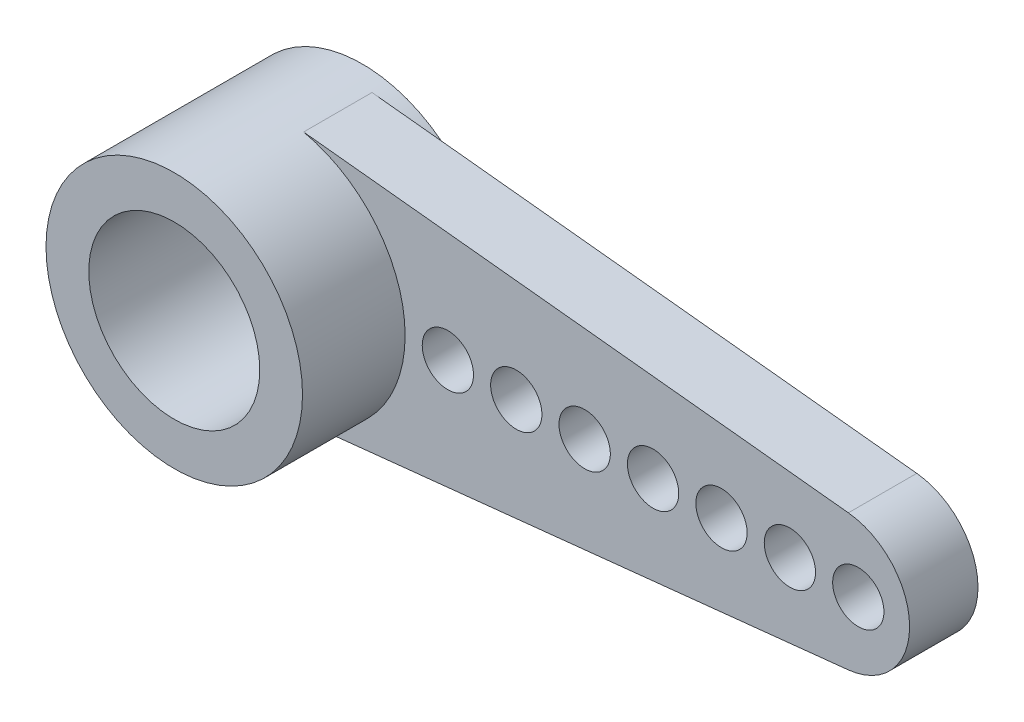
ISO-10303-21;
HEADER;
FILE_DESCRIPTION(('STEP AP214'),'2;1');
FILE_NAME('part.step','',(''),(''),'','','');
FILE_SCHEMA(('AUTOMOTIVE_DESIGN { 1 0 10303 214 1 1 1 1 }'));
ENDSEC;
DATA;
#1=APPLICATION_CONTEXT('core data for automotive mechanical design processes');
#2=APPLICATION_PROTOCOL_DEFINITION('international standard','automotive_design',2000,#1);
#3=PRODUCT_CONTEXT('',#1,'mechanical');
#4=PRODUCT('Part','Part','',(#3));
#5=PRODUCT_RELATED_PRODUCT_CATEGORY('part','',(#4));
#6=PRODUCT_DEFINITION_FORMATION('','',#4);
#7=PRODUCT_DEFINITION_CONTEXT('part definition',#1,'design');
#8=PRODUCT_DEFINITION('design','',#6,#7);
#9=PRODUCT_DEFINITION_SHAPE('','',#8);
#10=(LENGTH_UNIT() NAMED_UNIT(*) SI_UNIT(.MILLI.,.METRE.));
#11=(NAMED_UNIT(*) PLANE_ANGLE_UNIT() SI_UNIT($,.RADIAN.));
#12=(NAMED_UNIT(*) SI_UNIT($,.STERADIAN.) SOLID_ANGLE_UNIT());
#13=UNCERTAINTY_MEASURE_WITH_UNIT(LENGTH_MEASURE(1.E-05),#10,'distance_accuracy_value','');
#14=(GEOMETRIC_REPRESENTATION_CONTEXT(3) GLOBAL_UNCERTAINTY_ASSIGNED_CONTEXT((#13)) GLOBAL_UNIT_ASSIGNED_CONTEXT((#10,
#11,#12)) REPRESENTATION_CONTEXT('',''));
#15=CARTESIAN_POINT('',(0.,0.,0.));
#16=DIRECTION('',(0.,0.,1.));
#17=DIRECTION('',(1.,0.,0.));
#18=AXIS2_PLACEMENT_3D('',#15,#16,#17);
#19=CARTESIAN_POINT('',(0.,0.,-11.6066017177982));
#20=DIRECTION('',(0.,0.,1.));
#21=DIRECTION('',(1.,0.,0.));
#22=AXIS2_PLACEMENT_3D('',#19,#20,#21);
#23=CYLINDRICAL_SURFACE('',#22,2.5);
#24=CARTESIAN_POINT('',(0.,0.,5.));
#25=DIRECTION('',(0.,0.,1.));
#26=DIRECTION('',(1.,0.,0.));
#27=AXIS2_PLACEMENT_3D('',#24,#25,#26);
#28=CIRCLE('',#27,2.5);
#29=CARTESIAN_POINT('',(2.5,0.,5.));
#30=VERTEX_POINT('',#29);
#31=EDGE_CURVE('E140',#30,#30,#28,.T.);
#32=ORIENTED_EDGE('',*,*,#31,.T.);
#33=EDGE_LOOP('',(#32));
#34=FACE_BOUND('',#33,.T.);
#35=CARTESIAN_POINT('',(0.,0.,1.));
#36=DIRECTION('',(0.,0.,-1.));
#37=DIRECTION('',(-1.,0.,0.));
#38=AXIS2_PLACEMENT_3D('',#35,#36,#37);
#39=CIRCLE('',#38,2.5);
#40=CARTESIAN_POINT('',(-2.5,0.,1.));
#41=VERTEX_POINT('',#40);
#42=EDGE_CURVE('E185',#41,#41,#39,.T.);
#43=ORIENTED_EDGE('',*,*,#42,.T.);
#44=EDGE_LOOP('',(#43));
#45=FACE_BOUND('',#44,.T.);
#46=ADVANCED_FACE('F47',(#34,#45),#23,.F.);
#47=CARTESIAN_POINT('',(0.390868604120366,-3.70880662402365,2.));
#48=DIRECTION('',(0.104808874912201,-0.994492382947018,0.));
#49=DIRECTION('',(0.994492382947018,0.104808874912201,0.));
#50=AXIS2_PLACEMENT_3D('',#47,#48,#49);
#51=PLANE('',#50);
#52=DIRECTION('',(-0.994492382947018,-0.104808874912201,0.));
#53=VECTOR('',#52,1.);
#54=CARTESIAN_POINT('',(0.390868604120366,-3.70880662402365,0.));
#55=LINE('',#54,#53);
#56=CARTESIAN_POINT('',(16.7096177498244,-1.98898476589404,0.));
#57=VERTEX_POINT('',#56);
#58=CARTESIAN_POINT('',(0.781737208240732,-3.66761324804729,0.));
#59=VERTEX_POINT('',#58);
#60=EDGE_CURVE('E108',#57,#59,#55,.T.);
#61=ORIENTED_EDGE('',*,*,#60,.F.);
#62=DIRECTION('',(0.,0.,-1.));
#63=VECTOR('',#62,1.);
#64=CARTESIAN_POINT('',(16.7096177498244,-1.98898476589404,2.));
#65=LINE('',#64,#63);
#66=CARTESIAN_POINT('',(16.7096177498244,-1.98898476589404,2.));
#67=VERTEX_POINT('',#66);
#68=EDGE_CURVE('E57',#67,#57,#65,.T.);
#69=ORIENTED_EDGE('',*,*,#68,.F.);
#70=DIRECTION('',(-0.994492382947018,-0.104808874912201,0.));
#71=VECTOR('',#70,1.);
#72=CARTESIAN_POINT('',(0.390868604120366,-3.70880662402365,2.));
#73=LINE('',#72,#71);
#74=CARTESIAN_POINT('',(0.781737208240732,-3.66761324804729,2.));
#75=VERTEX_POINT('',#74);
#76=EDGE_CURVE('E109',#67,#75,#73,.T.);
#77=ORIENTED_EDGE('',*,*,#76,.T.);
#78=DIRECTION('',(0.,0.,-1.));
#79=VECTOR('',#78,1.);
#80=CARTESIAN_POINT('',(0.781737208240728,-3.66761324804729,2.));
#81=LINE('',#80,#79);
#82=EDGE_CURVE('E98',#75,#59,#81,.T.);
#83=ORIENTED_EDGE('',*,*,#82,.T.);
#84=EDGE_LOOP('',(#61,#69,#77,#83));
#85=FACE_BOUND('',#84,.T.);
#86=ADVANCED_FACE('F49',(#85),#51,.T.);
#87=CARTESIAN_POINT('',(16.5,0.,2.));
#88=DIRECTION('',(0.,0.,-1.));
#89=DIRECTION('',(-1.,0.,0.));
#90=AXIS2_PLACEMENT_3D('',#87,#88,#89);
#91=CYLINDRICAL_SURFACE('',#90,2.);
#92=CARTESIAN_POINT('',(16.5,0.,0.));
#93=DIRECTION('',(0.,0.,1.));
#94=DIRECTION('',(1.,0.,0.));
#95=AXIS2_PLACEMENT_3D('',#92,#93,#94);
#96=CIRCLE('',#95,2.);
#97=CARTESIAN_POINT('',(16.7096177498244,1.98898476589404,0.));
#98=VERTEX_POINT('',#97);
#99=EDGE_CURVE('E79',#57,#98,#96,.T.);
#100=ORIENTED_EDGE('',*,*,#99,.T.);
#101=DIRECTION('',(0.,0.,-1.));
#102=VECTOR('',#101,1.);
#103=CARTESIAN_POINT('',(16.7096177498244,1.98898476589404,2.));
#104=LINE('',#103,#102);
#105=CARTESIAN_POINT('',(16.7096177498244,1.98898476589404,2.));
#106=VERTEX_POINT('',#105);
#107=EDGE_CURVE('E97',#106,#98,#104,.T.);
#108=ORIENTED_EDGE('',*,*,#107,.F.);
#109=CARTESIAN_POINT('',(16.5,0.,2.));
#110=DIRECTION('',(0.,0.,1.));
#111=DIRECTION('',(1.,0.,0.));
#112=AXIS2_PLACEMENT_3D('',#109,#110,#111);
#113=CIRCLE('',#112,2.);
#114=EDGE_CURVE('E66',#67,#106,#113,.T.);
#115=ORIENTED_EDGE('',*,*,#114,.F.);
#116=ORIENTED_EDGE('',*,*,#68,.T.);
#117=EDGE_LOOP('',(#100,#108,#115,#116));
#118=FACE_BOUND('',#117,.T.);
#119=ADVANCED_FACE('F227',(#118),#91,.T.);
#120=CARTESIAN_POINT('',(0.390868604120364,3.70880662402365,2.));
#121=DIRECTION('',(-0.104808874912201,-0.994492382947018,0.));
#122=DIRECTION('',(0.994492382947018,-0.104808874912201,0.));
#123=AXIS2_PLACEMENT_3D('',#120,#121,#122);
#124=PLANE('',#123);
#125=DIRECTION('',(-0.994492382947018,0.104808874912201,0.));
#126=VECTOR('',#125,1.);
#127=CARTESIAN_POINT('',(0.390868604120364,3.70880662402365,0.));
#128=LINE('',#127,#126);
#129=CARTESIAN_POINT('',(0.781737208240722,3.66761324804729,0.));
#130=VERTEX_POINT('',#129);
#131=EDGE_CURVE('E101',#98,#130,#128,.T.);
#132=ORIENTED_EDGE('',*,*,#131,.T.);
#133=DIRECTION('',(0.,0.,-1.));
#134=VECTOR('',#133,1.);
#135=CARTESIAN_POINT('',(0.781737208240722,3.66761324804729,2.));
#136=LINE('',#135,#134);
#137=CARTESIAN_POINT('',(0.781737208240727,3.66761324804729,2.));
#138=VERTEX_POINT('',#137);
#139=EDGE_CURVE('E85',#138,#130,#136,.T.);
#140=ORIENTED_EDGE('',*,*,#139,.F.);
#141=DIRECTION('',(-0.994492382947018,0.104808874912201,0.));
#142=VECTOR('',#141,1.);
#143=CARTESIAN_POINT('',(0.390868604120364,3.70880662402365,2.));
#144=LINE('',#143,#142);
#145=EDGE_CURVE('E123',#106,#138,#144,.T.);
#146=ORIENTED_EDGE('',*,*,#145,.F.);
#147=ORIENTED_EDGE('',*,*,#107,.T.);
#148=EDGE_LOOP('',(#132,#140,#146,#147));
#149=FACE_BOUND('',#148,.T.);
#150=ADVANCED_FACE('F102',(#149),#124,.F.);
#151=CARTESIAN_POINT('',(0.,0.,2.));
#152=DIRECTION('',(0.,0.,1.));
#153=DIRECTION('',(1.,0.,0.));
#154=AXIS2_PLACEMENT_3D('',#151,#152,#153);
#155=PLANE('',#154);
#156=CARTESIAN_POINT('',(15.,0.,2.));
#157=DIRECTION('',(0.,0.,-1.));
#158=DIRECTION('',(-1.,0.,0.));
#159=AXIS2_PLACEMENT_3D('',#156,#157,#158);
#160=CIRCLE('',#159,0.75);
#161=CARTESIAN_POINT('',(14.25,0.,2.));
#162=VERTEX_POINT('',#161);
#163=EDGE_CURVE('E182',#162,#162,#160,.T.);
#164=ORIENTED_EDGE('',*,*,#163,.T.);
#165=EDGE_LOOP('',(#164));
#166=FACE_BOUND('',#165,.T.);
#167=CARTESIAN_POINT('',(5.,0.,2.));
#168=DIRECTION('',(0.,0.,-1.));
#169=DIRECTION('',(-1.,0.,0.));
#170=AXIS2_PLACEMENT_3D('',#167,#168,#169);
#171=CIRCLE('',#170,0.75);
#172=CARTESIAN_POINT('',(4.25,0.,2.));
#173=VERTEX_POINT('',#172);
#174=EDGE_CURVE('E176',#173,#173,#171,.T.);
#175=ORIENTED_EDGE('',*,*,#174,.T.);
#176=EDGE_LOOP('',(#175));
#177=FACE_BOUND('',#176,.T.);
#178=CARTESIAN_POINT('',(7.,0.,2.));
#179=DIRECTION('',(0.,0.,-1.));
#180=DIRECTION('',(-1.,0.,0.));
#181=AXIS2_PLACEMENT_3D('',#178,#179,#180);
#182=CIRCLE('',#181,0.75);
#183=CARTESIAN_POINT('',(6.25,0.,2.));
#184=VERTEX_POINT('',#183);
#185=EDGE_CURVE('E170',#184,#184,#182,.T.);
#186=ORIENTED_EDGE('',*,*,#185,.T.);
#187=EDGE_LOOP('',(#186));
#188=FACE_BOUND('',#187,.T.);
#189=CARTESIAN_POINT('',(9.,0.,2.));
#190=DIRECTION('',(0.,0.,-1.));
#191=DIRECTION('',(-1.,0.,0.));
#192=AXIS2_PLACEMENT_3D('',#189,#190,#191);
#193=CIRCLE('',#192,0.75);
#194=CARTESIAN_POINT('',(8.25,0.,2.));
#195=VERTEX_POINT('',#194);
#196=EDGE_CURVE('E164',#195,#195,#193,.T.);
#197=ORIENTED_EDGE('',*,*,#196,.T.);
#198=EDGE_LOOP('',(#197));
#199=FACE_BOUND('',#198,.T.);
#200=CARTESIAN_POINT('',(11.,0.,2.));
#201=DIRECTION('',(0.,0.,-1.));
#202=DIRECTION('',(-1.,0.,0.));
#203=AXIS2_PLACEMENT_3D('',#200,#201,#202);
#204=CIRCLE('',#203,0.75);
#205=CARTESIAN_POINT('',(10.25,0.,2.));
#206=VERTEX_POINT('',#205);
#207=EDGE_CURVE('E158',#206,#206,#204,.T.);
#208=ORIENTED_EDGE('',*,*,#207,.T.);
#209=EDGE_LOOP('',(#208));
#210=FACE_BOUND('',#209,.T.);
#211=CARTESIAN_POINT('',(13.,0.,2.));
#212=DIRECTION('',(0.,0.,-1.));
#213=DIRECTION('',(-1.,0.,0.));
#214=AXIS2_PLACEMENT_3D('',#211,#212,#213);
#215=CIRCLE('',#214,0.75);
#216=CARTESIAN_POINT('',(12.25,0.,2.));
#217=VERTEX_POINT('',#216);
#218=EDGE_CURVE('E152',#217,#217,#215,.T.);
#219=ORIENTED_EDGE('',*,*,#218,.T.);
#220=EDGE_LOOP('',(#219));
#221=FACE_BOUND('',#220,.T.);
#222=CARTESIAN_POINT('',(17.,0.,2.));
#223=DIRECTION('',(0.,0.,-1.));
#224=DIRECTION('',(-1.,0.,0.));
#225=AXIS2_PLACEMENT_3D('',#222,#223,#224);
#226=CIRCLE('',#225,0.750000000000002);
#227=CARTESIAN_POINT('',(16.25,0.,2.));
#228=VERTEX_POINT('',#227);
#229=EDGE_CURVE('E145',#228,#228,#226,.T.);
#230=ORIENTED_EDGE('',*,*,#229,.T.);
#231=EDGE_LOOP('',(#230));
#232=FACE_BOUND('',#231,.T.);
#233=CARTESIAN_POINT('',(0.,0.,2.));
#234=DIRECTION('',(0.,0.,1.));
#235=DIRECTION('',(1.,0.,0.));
#236=AXIS2_PLACEMENT_3D('',#233,#234,#235);
#237=CIRCLE('',#236,3.75);
#238=EDGE_CURVE('E13',#75,#138,#237,.T.);
#239=ORIENTED_EDGE('',*,*,#238,.F.);
#240=ORIENTED_EDGE('',*,*,#76,.F.);
#241=ORIENTED_EDGE('',*,*,#114,.T.);
#242=ORIENTED_EDGE('',*,*,#145,.T.);
#243=EDGE_LOOP('',(#239,#240,#241,#242));
#244=FACE_BOUND('',#243,.T.);
#245=ADVANCED_FACE('F399',(#166,#177,#188,#199,#210,#221,#232,#244),#155,.T.);
#246=CARTESIAN_POINT('',(0.,0.,0.));
#247=DIRECTION('',(0.,0.,1.));
#248=DIRECTION('',(1.,0.,0.));
#249=AXIS2_PLACEMENT_3D('',#246,#247,#248);
#250=PLANE('',#249);
#251=CARTESIAN_POINT('',(15.,0.,0.));
#252=DIRECTION('',(0.,0.,-1.));
#253=DIRECTION('',(-1.,0.,0.));
#254=AXIS2_PLACEMENT_3D('',#251,#252,#253);
#255=CIRCLE('',#254,0.75);
#256=CARTESIAN_POINT('',(14.25,0.,0.));
#257=VERTEX_POINT('',#256);
#258=EDGE_CURVE('E179',#257,#257,#255,.T.);
#259=ORIENTED_EDGE('',*,*,#258,.F.);
#260=EDGE_LOOP('',(#259));
#261=FACE_BOUND('',#260,.T.);
#262=CARTESIAN_POINT('',(5.,0.,0.));
#263=DIRECTION('',(0.,0.,-1.));
#264=DIRECTION('',(-1.,0.,0.));
#265=AXIS2_PLACEMENT_3D('',#262,#263,#264);
#266=CIRCLE('',#265,0.75);
#267=CARTESIAN_POINT('',(4.25,0.,0.));
#268=VERTEX_POINT('',#267);
#269=EDGE_CURVE('E173',#268,#268,#266,.T.);
#270=ORIENTED_EDGE('',*,*,#269,.F.);
#271=EDGE_LOOP('',(#270));
#272=FACE_BOUND('',#271,.T.);
#273=CARTESIAN_POINT('',(7.,0.,0.));
#274=DIRECTION('',(0.,0.,-1.));
#275=DIRECTION('',(-1.,0.,0.));
#276=AXIS2_PLACEMENT_3D('',#273,#274,#275);
#277=CIRCLE('',#276,0.75);
#278=CARTESIAN_POINT('',(6.25,0.,0.));
#279=VERTEX_POINT('',#278);
#280=EDGE_CURVE('E167',#279,#279,#277,.T.);
#281=ORIENTED_EDGE('',*,*,#280,.F.);
#282=EDGE_LOOP('',(#281));
#283=FACE_BOUND('',#282,.T.);
#284=CARTESIAN_POINT('',(9.,0.,0.));
#285=DIRECTION('',(0.,0.,-1.));
#286=DIRECTION('',(-1.,0.,0.));
#287=AXIS2_PLACEMENT_3D('',#284,#285,#286);
#288=CIRCLE('',#287,0.75);
#289=CARTESIAN_POINT('',(8.25,0.,0.));
#290=VERTEX_POINT('',#289);
#291=EDGE_CURVE('E161',#290,#290,#288,.T.);
#292=ORIENTED_EDGE('',*,*,#291,.F.);
#293=EDGE_LOOP('',(#292));
#294=FACE_BOUND('',#293,.T.);
#295=CARTESIAN_POINT('',(11.,0.,0.));
#296=DIRECTION('',(0.,0.,-1.));
#297=DIRECTION('',(-1.,0.,0.));
#298=AXIS2_PLACEMENT_3D('',#295,#296,#297);
#299=CIRCLE('',#298,0.75);
#300=CARTESIAN_POINT('',(10.25,0.,0.));
#301=VERTEX_POINT('',#300);
#302=EDGE_CURVE('E155',#301,#301,#299,.T.);
#303=ORIENTED_EDGE('',*,*,#302,.F.);
#304=EDGE_LOOP('',(#303));
#305=FACE_BOUND('',#304,.T.);
#306=CARTESIAN_POINT('',(13.,0.,0.));
#307=DIRECTION('',(0.,0.,-1.));
#308=DIRECTION('',(-1.,0.,0.));
#309=AXIS2_PLACEMENT_3D('',#306,#307,#308);
#310=CIRCLE('',#309,0.75);
#311=CARTESIAN_POINT('',(12.25,0.,0.));
#312=VERTEX_POINT('',#311);
#313=EDGE_CURVE('E149',#312,#312,#310,.T.);
#314=ORIENTED_EDGE('',*,*,#313,.F.);
#315=EDGE_LOOP('',(#314));
#316=FACE_BOUND('',#315,.T.);
#317=CARTESIAN_POINT('',(17.,0.,0.));
#318=DIRECTION('',(0.,0.,-1.));
#319=DIRECTION('',(-1.,0.,0.));
#320=AXIS2_PLACEMENT_3D('',#317,#318,#319);
#321=CIRCLE('',#320,0.750000000000002);
#322=CARTESIAN_POINT('',(16.25,0.,0.));
#323=VERTEX_POINT('',#322);
#324=EDGE_CURVE('E146',#323,#323,#321,.T.);
#325=ORIENTED_EDGE('',*,*,#324,.F.);
#326=EDGE_LOOP('',(#325));
#327=FACE_BOUND('',#326,.T.);
#328=ORIENTED_EDGE('',*,*,#60,.T.);
#329=CARTESIAN_POINT('',(0.,0.,0.));
#330=DIRECTION('',(0.,0.,1.));
#331=DIRECTION('',(1.,0.,0.));
#332=AXIS2_PLACEMENT_3D('',#329,#330,#331);
#333=CIRCLE('',#332,3.75);
#334=EDGE_CURVE('E91',#59,#130,#333,.T.);
#335=ORIENTED_EDGE('',*,*,#334,.T.);
#336=ORIENTED_EDGE('',*,*,#131,.F.);
#337=ORIENTED_EDGE('',*,*,#99,.F.);
#338=EDGE_LOOP('',(#328,#335,#336,#337));
#339=FACE_BOUND('',#338,.T.);
#340=ADVANCED_FACE('F106',(#261,#272,#283,#294,#305,#316,#327,#339),#250,.F.);
#341=CARTESIAN_POINT('',(0.,0.,-11.6066017177982));
#342=DIRECTION('',(0.,0.,1.));
#343=DIRECTION('',(1.,0.,0.));
#344=AXIS2_PLACEMENT_3D('',#341,#342,#343);
#345=CYLINDRICAL_SURFACE('',#344,3.75);
#346=ORIENTED_EDGE('',*,*,#82,.F.);
#347=ORIENTED_EDGE('',*,*,#238,.T.);
#348=ORIENTED_EDGE('',*,*,#139,.T.);
#349=ORIENTED_EDGE('',*,*,#334,.F.);
#350=EDGE_LOOP('',(#346,#347,#348,#349));
#351=FACE_BOUND('',#350,.T.);
#352=CARTESIAN_POINT('',(0.,0.,-0.5));
#353=DIRECTION('',(0.,0.,1.));
#354=DIRECTION('',(1.,0.,0.));
#355=AXIS2_PLACEMENT_3D('',#352,#353,#354);
#356=CIRCLE('',#355,3.75);
#357=CARTESIAN_POINT('',(3.75,0.,-0.5));
#358=VERTEX_POINT('',#357);
#359=EDGE_CURVE('E133',#358,#358,#356,.T.);
#360=ORIENTED_EDGE('',*,*,#359,.T.);
#361=EDGE_LOOP('',(#360));
#362=FACE_BOUND('',#361,.T.);
#363=CARTESIAN_POINT('',(0.,0.,5.));
#364=DIRECTION('',(0.,0.,1.));
#365=DIRECTION('',(1.,0.,0.));
#366=AXIS2_PLACEMENT_3D('',#363,#364,#365);
#367=CIRCLE('',#366,3.75);
#368=CARTESIAN_POINT('',(3.75,0.,5.));
#369=VERTEX_POINT('',#368);
#370=EDGE_CURVE('E137',#369,#369,#367,.T.);
#371=ORIENTED_EDGE('',*,*,#370,.F.);
#372=EDGE_LOOP('',(#371));
#373=FACE_BOUND('',#372,.T.);
#374=ADVANCED_FACE('F88',(#351,#362,#373),#345,.T.);
#375=CARTESIAN_POINT('',(0.,0.,-0.5));
#376=DIRECTION('',(0.,0.,1.));
#377=DIRECTION('',(1.,0.,0.));
#378=AXIS2_PLACEMENT_3D('',#375,#376,#377);
#379=CIRCLE('',#378,2.5);
#380=CARTESIAN_POINT('',(2.5,0.,-0.5));
#381=VERTEX_POINT('',#380);
#382=EDGE_CURVE('E130',#381,#381,#379,.T.);
#383=ORIENTED_EDGE('',*,*,#382,.F.);
#384=EDGE_LOOP('',(#383));
#385=FACE_BOUND('',#384,.T.);
#386=CARTESIAN_POINT('',(0.,0.,0.5));
#387=DIRECTION('',(0.,0.,-1.));
#388=DIRECTION('',(-1.,0.,0.));
#389=AXIS2_PLACEMENT_3D('',#386,#387,#388);
#390=CIRCLE('',#389,2.5);
#391=CARTESIAN_POINT('',(-2.5,0.,0.5));
#392=VERTEX_POINT('',#391);
#393=EDGE_CURVE('E190',#392,#392,#390,.T.);
#394=ORIENTED_EDGE('',*,*,#393,.F.);
#395=EDGE_LOOP('',(#394));
#396=FACE_BOUND('',#395,.T.);
#397=ADVANCED_FACE('F210',(#385,#396),#23,.F.);
#398=CARTESIAN_POINT('',(0.,0.,-0.5));
#399=DIRECTION('',(0.,0.,1.));
#400=DIRECTION('',(1.,0.,0.));
#401=AXIS2_PLACEMENT_3D('',#398,#399,#400);
#402=PLANE('',#401);
#403=ORIENTED_EDGE('',*,*,#382,.T.);
#404=EDGE_LOOP('',(#403));
#405=FACE_BOUND('',#404,.T.);
#406=ORIENTED_EDGE('',*,*,#359,.F.);
#407=EDGE_LOOP('',(#406));
#408=FACE_BOUND('',#407,.T.);
#409=ADVANCED_FACE('F212',(#405,#408),#402,.F.);
#410=CARTESIAN_POINT('',(0.,0.,5.));
#411=DIRECTION('',(0.,0.,1.));
#412=DIRECTION('',(1.,0.,0.));
#413=AXIS2_PLACEMENT_3D('',#410,#411,#412);
#414=PLANE('',#413);
#415=ORIENTED_EDGE('',*,*,#370,.T.);
#416=EDGE_LOOP('',(#415));
#417=FACE_BOUND('',#416,.T.);
#418=ORIENTED_EDGE('',*,*,#31,.F.);
#419=EDGE_LOOP('',(#418));
#420=FACE_BOUND('',#419,.T.);
#421=ADVANCED_FACE('F219',(#417,#420),#414,.T.);
#422=CARTESIAN_POINT('',(17.,0.,2.));
#423=DIRECTION('',(0.,0.,-1.));
#424=DIRECTION('',(-1.,0.,0.));
#425=AXIS2_PLACEMENT_3D('',#422,#423,#424);
#426=CYLINDRICAL_SURFACE('',#425,0.750000000000002);
#427=ORIENTED_EDGE('',*,*,#229,.F.);
#428=EDGE_LOOP('',(#427));
#429=FACE_BOUND('',#428,.T.);
#430=ORIENTED_EDGE('',*,*,#324,.T.);
#431=EDGE_LOOP('',(#430));
#432=FACE_BOUND('',#431,.T.);
#433=ADVANCED_FACE('F262',(#429,#432),#426,.F.);
#434=CARTESIAN_POINT('',(13.,0.,2.));
#435=DIRECTION('',(0.,0.,-1.));
#436=DIRECTION('',(-1.,0.,0.));
#437=AXIS2_PLACEMENT_3D('',#434,#435,#436);
#438=CYLINDRICAL_SURFACE('',#437,0.75);
#439=ORIENTED_EDGE('',*,*,#218,.F.);
#440=EDGE_LOOP('',(#439));
#441=FACE_BOUND('',#440,.T.);
#442=ORIENTED_EDGE('',*,*,#313,.T.);
#443=EDGE_LOOP('',(#442));
#444=FACE_BOUND('',#443,.T.);
#445=ADVANCED_FACE('F258',(#441,#444),#438,.F.);
#446=CARTESIAN_POINT('',(11.,0.,2.));
#447=DIRECTION('',(0.,0.,-1.));
#448=DIRECTION('',(-1.,0.,0.));
#449=AXIS2_PLACEMENT_3D('',#446,#447,#448);
#450=CYLINDRICAL_SURFACE('',#449,0.75);
#451=ORIENTED_EDGE('',*,*,#207,.F.);
#452=EDGE_LOOP('',(#451));
#453=FACE_BOUND('',#452,.T.);
#454=ORIENTED_EDGE('',*,*,#302,.T.);
#455=EDGE_LOOP('',(#454));
#456=FACE_BOUND('',#455,.T.);
#457=ADVANCED_FACE('F254',(#453,#456),#450,.F.);
#458=CARTESIAN_POINT('',(9.,0.,2.));
#459=DIRECTION('',(0.,0.,-1.));
#460=DIRECTION('',(-1.,0.,0.));
#461=AXIS2_PLACEMENT_3D('',#458,#459,#460);
#462=CYLINDRICAL_SURFACE('',#461,0.75);
#463=ORIENTED_EDGE('',*,*,#196,.F.);
#464=EDGE_LOOP('',(#463));
#465=FACE_BOUND('',#464,.T.);
#466=ORIENTED_EDGE('',*,*,#291,.T.);
#467=EDGE_LOOP('',(#466));
#468=FACE_BOUND('',#467,.T.);
#469=ADVANCED_FACE('F250',(#465,#468),#462,.F.);
#470=CARTESIAN_POINT('',(7.,0.,2.));
#471=DIRECTION('',(0.,0.,-1.));
#472=DIRECTION('',(-1.,0.,0.));
#473=AXIS2_PLACEMENT_3D('',#470,#471,#472);
#474=CYLINDRICAL_SURFACE('',#473,0.75);
#475=ORIENTED_EDGE('',*,*,#185,.F.);
#476=EDGE_LOOP('',(#475));
#477=FACE_BOUND('',#476,.T.);
#478=ORIENTED_EDGE('',*,*,#280,.T.);
#479=EDGE_LOOP('',(#478));
#480=FACE_BOUND('',#479,.T.);
#481=ADVANCED_FACE('F246',(#477,#480),#474,.F.);
#482=CARTESIAN_POINT('',(5.,0.,2.));
#483=DIRECTION('',(0.,0.,-1.));
#484=DIRECTION('',(-1.,0.,0.));
#485=AXIS2_PLACEMENT_3D('',#482,#483,#484);
#486=CYLINDRICAL_SURFACE('',#485,0.75);
#487=ORIENTED_EDGE('',*,*,#174,.F.);
#488=EDGE_LOOP('',(#487));
#489=FACE_BOUND('',#488,.T.);
#490=ORIENTED_EDGE('',*,*,#269,.T.);
#491=EDGE_LOOP('',(#490));
#492=FACE_BOUND('',#491,.T.);
#493=ADVANCED_FACE('F239',(#489,#492),#486,.F.);
#494=CARTESIAN_POINT('',(15.,0.,2.));
#495=DIRECTION('',(0.,0.,-1.));
#496=DIRECTION('',(-1.,0.,0.));
#497=AXIS2_PLACEMENT_3D('',#494,#495,#496);
#498=CYLINDRICAL_SURFACE('',#497,0.75);
#499=ORIENTED_EDGE('',*,*,#163,.F.);
#500=EDGE_LOOP('',(#499));
#501=FACE_BOUND('',#500,.T.);
#502=ORIENTED_EDGE('',*,*,#258,.T.);
#503=EDGE_LOOP('',(#502));
#504=FACE_BOUND('',#503,.T.);
#505=ADVANCED_FACE('F233',(#501,#504),#498,.F.);
#506=CARTESIAN_POINT('',(0.,0.,1.));
#507=DIRECTION('',(0.,0.,-1.));
#508=DIRECTION('',(-1.,0.,0.));
#509=AXIS2_PLACEMENT_3D('',#506,#507,#508);
#510=PLANE('',#509);
#511=CARTESIAN_POINT('',(0.,0.,1.));
#512=DIRECTION('',(0.,0.,-1.));
#513=DIRECTION('',(-1.,0.,0.));
#514=AXIS2_PLACEMENT_3D('',#511,#512,#513);
#515=CIRCLE('',#514,1.25);
#516=CARTESIAN_POINT('',(-1.25,0.,1.));
#517=VERTEX_POINT('',#516);
#518=EDGE_CURVE('E193',#517,#517,#515,.T.);
#519=ORIENTED_EDGE('',*,*,#518,.T.);
#520=EDGE_LOOP('',(#519));
#521=FACE_BOUND('',#520,.T.);
#522=ORIENTED_EDGE('',*,*,#42,.F.);
#523=EDGE_LOOP('',(#522));
#524=FACE_BOUND('',#523,.T.);
#525=ADVANCED_FACE('F206',(#521,#524),#510,.F.);
#526=CARTESIAN_POINT('',(0.,0.,0.5));
#527=DIRECTION('',(0.,0.,-1.));
#528=DIRECTION('',(-1.,0.,0.));
#529=AXIS2_PLACEMENT_3D('',#526,#527,#528);
#530=PLANE('',#529);
#531=CARTESIAN_POINT('',(0.,0.,0.5));
#532=DIRECTION('',(0.,0.,-1.));
#533=DIRECTION('',(-1.,0.,0.));
#534=AXIS2_PLACEMENT_3D('',#531,#532,#533);
#535=CIRCLE('',#534,1.25);
#536=CARTESIAN_POINT('',(-1.25,0.,0.5));
#537=VERTEX_POINT('',#536);
#538=EDGE_CURVE('E196',#537,#537,#535,.T.);
#539=ORIENTED_EDGE('',*,*,#538,.F.);
#540=EDGE_LOOP('',(#539));
#541=FACE_BOUND('',#540,.T.);
#542=ORIENTED_EDGE('',*,*,#393,.T.);
#543=EDGE_LOOP('',(#542));
#544=FACE_BOUND('',#543,.T.);
#545=ADVANCED_FACE('F203',(#541,#544),#530,.T.);
#546=CARTESIAN_POINT('',(0.,0.,5.5));
#547=DIRECTION('',(0.,0.,-1.));
#548=DIRECTION('',(-1.,0.,0.));
#549=AXIS2_PLACEMENT_3D('',#546,#547,#548);
#550=CYLINDRICAL_SURFACE('',#549,1.25);
#551=ORIENTED_EDGE('',*,*,#538,.T.);
#552=EDGE_LOOP('',(#551));
#553=FACE_BOUND('',#552,.T.);
#554=ORIENTED_EDGE('',*,*,#518,.F.);
#555=EDGE_LOOP('',(#554));
#556=FACE_BOUND('',#555,.T.);
#557=ADVANCED_FACE('F200',(#553,#556),#550,.F.);
#558=CLOSED_SHELL('',(#46,#86,#119,#150,#245,#340,#374,#397,#409,#421,#433,#445,#457,#469,#481,
#493,#505,#525,#545,#557));
#559=MANIFOLD_SOLID_BREP('B2',#558);
#560=ADVANCED_BREP_SHAPE_REPRESENTATION('',(#18,#559),#14);
#561=SHAPE_DEFINITION_REPRESENTATION(#9,#560);
ENDSEC;
END-ISO-10303-21;
